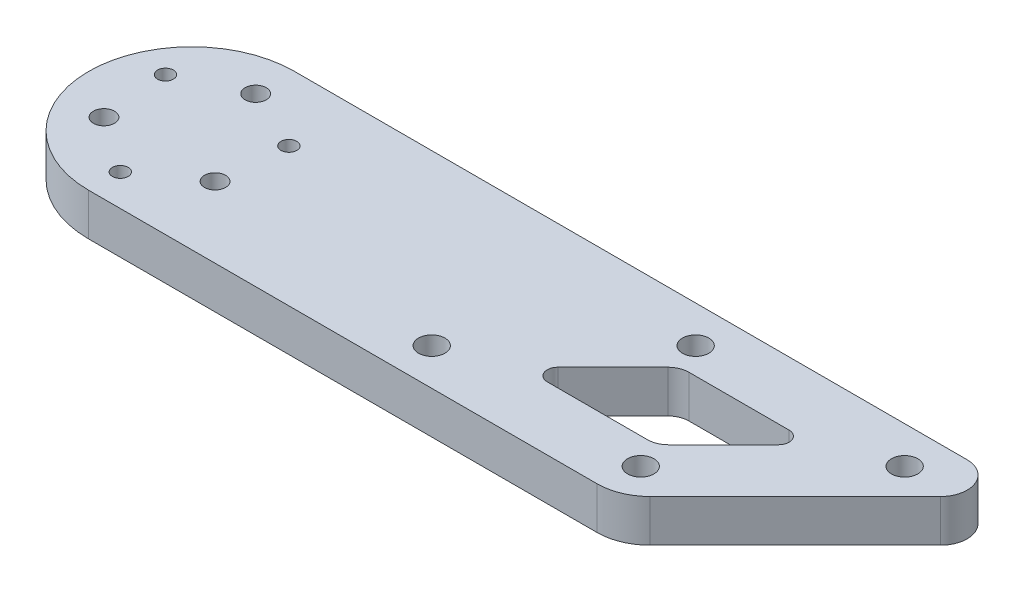
ISO-10303-21;
HEADER;
FILE_DESCRIPTION(('STEP AP214'),'2;1');
FILE_NAME('part.step','',(''),(''),'','','');
FILE_SCHEMA(('AUTOMOTIVE_DESIGN { 1 0 10303 214 1 1 1 1 }'));
ENDSEC;
DATA;
#1=APPLICATION_CONTEXT('core data for automotive mechanical design processes');
#2=APPLICATION_PROTOCOL_DEFINITION('international standard','automotive_design',2000,#1);
#3=PRODUCT_CONTEXT('',#1,'mechanical');
#4=PRODUCT('Part','Part','',(#3));
#5=PRODUCT_RELATED_PRODUCT_CATEGORY('part','',(#4));
#6=PRODUCT_DEFINITION_FORMATION('','',#4);
#7=PRODUCT_DEFINITION_CONTEXT('part definition',#1,'design');
#8=PRODUCT_DEFINITION('design','',#6,#7);
#9=PRODUCT_DEFINITION_SHAPE('','',#8);
#10=(LENGTH_UNIT() NAMED_UNIT(*) SI_UNIT(.MILLI.,.METRE.));
#11=(NAMED_UNIT(*) PLANE_ANGLE_UNIT() SI_UNIT($,.RADIAN.));
#12=(NAMED_UNIT(*) SI_UNIT($,.STERADIAN.) SOLID_ANGLE_UNIT());
#13=UNCERTAINTY_MEASURE_WITH_UNIT(LENGTH_MEASURE(1.E-05),#10,'distance_accuracy_value','');
#14=(GEOMETRIC_REPRESENTATION_CONTEXT(3) GLOBAL_UNCERTAINTY_ASSIGNED_CONTEXT((#13)) GLOBAL_UNIT_ASSIGNED_CONTEXT((#10,
#11,#12)) REPRESENTATION_CONTEXT('',''));
#15=CARTESIAN_POINT('',(0.,0.,0.));
#16=DIRECTION('',(0.,0.,1.));
#17=DIRECTION('',(1.,0.,0.));
#18=AXIS2_PLACEMENT_3D('',#15,#16,#17);
#19=CARTESIAN_POINT('',(0.,8.,0.));
#20=DIRECTION('',(0.,1.,0.));
#21=DIRECTION('',(0.,0.,1.));
#22=AXIS2_PLACEMENT_3D('',#19,#20,#21);
#23=PLANE('',#22);
#24=CARTESIAN_POINT('',(58.0025253169416,8.,12.5000000000001));
#25=DIRECTION('',(0.,-1.,0.));
#26=DIRECTION('',(0.,0.,-1.));
#27=AXIS2_PLACEMENT_3D('',#24,#25,#26);
#28=CIRCLE('',#27,2.5);
#29=CARTESIAN_POINT('',(58.0025253169416,8.,10.0000000000001));
#30=VERTEX_POINT('',#29);
#31=EDGE_CURVE('E618',#30,#30,#28,.T.);
#32=ORIENTED_EDGE('',*,*,#31,.T.);
#33=EDGE_LOOP('',(#32));
#34=FACE_BOUND('',#33,.T.);
#35=CARTESIAN_POINT('',(83.0025253169414,8.,-12.4999999999998));
#36=DIRECTION('',(0.,-1.,0.));
#37=DIRECTION('',(0.,0.,-1.));
#38=AXIS2_PLACEMENT_3D('',#35,#36,#37);
#39=CIRCLE('',#38,2.50000000000001);
#40=CARTESIAN_POINT('',(83.0025253169414,8.,-14.9999999999998));
#41=VERTEX_POINT('',#40);
#42=EDGE_CURVE('E614',#41,#41,#39,.T.);
#43=ORIENTED_EDGE('',*,*,#42,.T.);
#44=EDGE_LOOP('',(#43));
#45=FACE_BOUND('',#44,.T.);
#46=CARTESIAN_POINT('',(122.600505063388,8.,-12.4999999999998));
#47=DIRECTION('',(0.,-1.,0.));
#48=DIRECTION('',(0.,0.,-1.));
#49=AXIS2_PLACEMENT_3D('',#46,#47,#48);
#50=CIRCLE('',#49,2.49999999999999);
#51=CARTESIAN_POINT('',(122.600505063388,8.,-14.9999999999998));
#52=VERTEX_POINT('',#51);
#53=EDGE_CURVE('E494',#52,#52,#50,.T.);
#54=ORIENTED_EDGE('',*,*,#53,.T.);
#55=EDGE_LOOP('',(#54));
#56=FACE_BOUND('',#55,.T.);
#57=CARTESIAN_POINT('',(97.6005050633882,8.,12.5000000000001));
#58=DIRECTION('',(0.,-1.,0.));
#59=DIRECTION('',(0.,0.,-1.));
#60=AXIS2_PLACEMENT_3D('',#57,#58,#59);
#61=CIRCLE('',#60,2.50000000000001);
#62=CARTESIAN_POINT('',(97.6005050633882,8.,10.0000000000001));
#63=VERTEX_POINT('',#62);
#64=EDGE_CURVE('E161',#63,#63,#61,.T.);
#65=ORIENTED_EDGE('',*,*,#64,.T.);
#66=EDGE_LOOP('',(#65));
#67=FACE_BOUND('',#66,.T.);
#68=CARTESIAN_POINT('',(93.8725830020304,8.,3.49999999999995));
#69=DIRECTION('',(0.,-1.,0.));
#70=DIRECTION('',(0.,0.,1.));
#71=AXIS2_PLACEMENT_3D('',#68,#69,#70);
#72=CIRCLE('',#71,4.00000000000001);
#73=CARTESIAN_POINT('',(96.7010101267766,8.,6.32842712474616));
#74=VERTEX_POINT('',#73);
#75=CARTESIAN_POINT('',(93.8725830020304,8.,7.49999999999996));
#76=VERTEX_POINT('',#75);
#77=EDGE_CURVE('E139',#74,#76,#72,.T.);
#78=ORIENTED_EDGE('',*,*,#77,.T.);
#79=DIRECTION('',(-1.,0.,0.));
#80=VECTOR('',#79,1.);
#81=CARTESIAN_POINT('',(93.8725830020304,8.,7.49999999999996));
#82=LINE('',#81,#80);
#83=CARTESIAN_POINT('',(74.9020202535533,8.,7.49999999999996));
#84=VERTEX_POINT('',#83);
#85=EDGE_CURVE('E148',#76,#84,#82,.T.);
#86=ORIENTED_EDGE('',*,*,#85,.T.);
#87=CARTESIAN_POINT('',(74.9020202535533,8.,5.49999999999996));
#88=DIRECTION('',(0.,-1.,0.));
#89=DIRECTION('',(0.,0.,-1.));
#90=AXIS2_PLACEMENT_3D('',#87,#88,#89);
#91=CIRCLE('',#90,2.);
#92=CARTESIAN_POINT('',(73.4878066911802,8.,4.08578643762688));
#93=VERTEX_POINT('',#92);
#94=EDGE_CURVE('E51',#84,#93,#91,.T.);
#95=ORIENTED_EDGE('',*,*,#94,.T.);
#96=DIRECTION('',(0.707106781186546,0.,-0.707106781186549));
#97=VECTOR('',#96,1.);
#98=CARTESIAN_POINT('',(73.4878066911802,8.,4.08578643762687));
#99=LINE('',#98,#97);
#100=CARTESIAN_POINT('',(83.9020202535532,8.,-6.32842712474621));
#101=VERTEX_POINT('',#100);
#102=EDGE_CURVE('E165',#93,#101,#99,.T.);
#103=ORIENTED_EDGE('',*,*,#102,.T.);
#104=CARTESIAN_POINT('',(86.7304473782994,8.,-3.50000000000002));
#105=DIRECTION('',(0.,-1.,0.));
#106=DIRECTION('',(0.,0.,1.));
#107=AXIS2_PLACEMENT_3D('',#104,#105,#106);
#108=CIRCLE('',#107,4.);
#109=CARTESIAN_POINT('',(86.7304473782994,8.,-7.50000000000002));
#110=VERTEX_POINT('',#109);
#111=EDGE_CURVE('E168',#101,#110,#108,.T.);
#112=ORIENTED_EDGE('',*,*,#111,.T.);
#113=DIRECTION('',(1.,0.,0.));
#114=VECTOR('',#113,1.);
#115=CARTESIAN_POINT('',(105.701010126777,8.,-7.50000000000003));
#116=LINE('',#115,#114);
#117=CARTESIAN_POINT('',(105.701010126777,8.,-7.50000000000003));
#118=VERTEX_POINT('',#117);
#119=EDGE_CURVE('E171',#110,#118,#116,.T.);
#120=ORIENTED_EDGE('',*,*,#119,.T.);
#121=CARTESIAN_POINT('',(105.701010126777,8.,-5.50000000000003));
#122=DIRECTION('',(0.,-1.,0.));
#123=DIRECTION('',(0.,0.,1.));
#124=AXIS2_PLACEMENT_3D('',#121,#122,#123);
#125=CIRCLE('',#124,2.);
#126=CARTESIAN_POINT('',(107.11522368915,8.,-4.08578643762694));
#127=VERTEX_POINT('',#126);
#128=EDGE_CURVE('E174',#118,#127,#125,.T.);
#129=ORIENTED_EDGE('',*,*,#128,.T.);
#130=DIRECTION('',(-0.707106781186547,0.,0.707106781186548));
#131=VECTOR('',#130,1.);
#132=CARTESIAN_POINT('',(96.7010101267766,8.,6.32842712474616));
#133=LINE('',#132,#131);
#134=EDGE_CURVE('E145',#127,#74,#133,.T.);
#135=ORIENTED_EDGE('',*,*,#134,.T.);
#136=EDGE_LOOP('',(#78,#86,#95,#103,#112,#120,#129,#135));
#137=FACE_BOUND('',#136,.T.);
#138=CARTESIAN_POINT('',(11.6913429510899,8.,-6.75));
#139=DIRECTION('',(0.,1.,0.));
#140=DIRECTION('',(0.,0.,1.));
#141=AXIS2_PLACEMENT_3D('',#138,#139,#140);
#142=CIRCLE('',#141,1.5);
#143=CARTESIAN_POINT('',(11.6913429510899,8.,-5.25));
#144=VERTEX_POINT('',#143);
#145=EDGE_CURVE('E214',#144,#144,#142,.T.);
#146=ORIENTED_EDGE('',*,*,#145,.F.);
#147=EDGE_LOOP('',(#146));
#148=FACE_BOUND('',#147,.T.);
#149=CARTESIAN_POINT('',(10.522208655981,8.,6.0749999999999));
#150=DIRECTION('',(0.,1.,0.));
#151=DIRECTION('',(0.,0.,1.));
#152=AXIS2_PLACEMENT_3D('',#149,#150,#151);
#153=CIRCLE('',#152,2.);
#154=CARTESIAN_POINT('',(10.522208655981,8.,8.0749999999999));
#155=VERTEX_POINT('',#154);
#156=EDGE_CURVE('E226',#155,#155,#153,.T.);
#157=ORIENTED_EDGE('',*,*,#156,.F.);
#158=EDGE_LOOP('',(#157));
#159=FACE_BOUND('',#158,.T.);
#160=CARTESIAN_POINT('',(-10.5222086559809,8.,6.07500000000005));
#161=DIRECTION('',(0.,1.,0.));
#162=DIRECTION('',(0.,0.,1.));
#163=AXIS2_PLACEMENT_3D('',#160,#161,#162);
#164=CIRCLE('',#163,2.);
#165=CARTESIAN_POINT('',(-10.5222086559809,8.,8.07500000000005));
#166=VERTEX_POINT('',#165);
#167=EDGE_CURVE('E238',#166,#166,#164,.T.);
#168=ORIENTED_EDGE('',*,*,#167,.F.);
#169=EDGE_LOOP('',(#168));
#170=FACE_BOUND('',#169,.T.);
#171=CARTESIAN_POINT('',(0.,8.,0.));
#172=DIRECTION('',(0.,1.,0.));
#173=DIRECTION('',(0.,0.,1.));
#174=AXIS2_PLACEMENT_3D('',#171,#172,#173);
#175=CIRCLE('',#174,19.5);
#176=CARTESIAN_POINT('',(0.,8.,-19.5));
#177=VERTEX_POINT('',#176);
#178=CARTESIAN_POINT('',(0.,8.,19.5));
#179=VERTEX_POINT('',#178);
#180=EDGE_CURVE('E244',#177,#179,#175,.T.);
#181=ORIENTED_EDGE('',*,*,#180,.T.);
#182=DIRECTION('',(1.,0.,0.));
#183=VECTOR('',#182,1.);
#184=CARTESIAN_POINT('',(0.,8.,19.5));
#185=LINE('',#184,#183);
#186=CARTESIAN_POINT('',(96.3578643762691,8.,19.5));
#187=VERTEX_POINT('',#186);
#188=EDGE_CURVE('E247',#179,#187,#185,.T.);
#189=ORIENTED_EDGE('',*,*,#188,.T.);
#190=CARTESIAN_POINT('',(96.3578643762691,8.,9.5));
#191=DIRECTION('',(0.,1.,0.));
#192=DIRECTION('',(0.,0.,1.));
#193=AXIS2_PLACEMENT_3D('',#190,#191,#192);
#194=CIRCLE('',#193,10.);
#195=CARTESIAN_POINT('',(103.428932188135,8.,16.5710678118655));
#196=VERTEX_POINT('',#195);
#197=EDGE_CURVE('E250',#187,#196,#194,.T.);
#198=ORIENTED_EDGE('',*,*,#197,.T.);
#199=DIRECTION('',(0.707106781186546,0.,-0.707106781186549));
#200=VECTOR('',#199,1.);
#201=CARTESIAN_POINT('',(103.428932188135,8.,16.5710678118655));
#202=LINE('',#201,#200);
#203=CARTESIAN_POINT('',(130.964466094067,8.,-10.9644660940673));
#204=VERTEX_POINT('',#203);
#205=EDGE_CURVE('E252',#196,#204,#202,.T.);
#206=ORIENTED_EDGE('',*,*,#205,.T.);
#207=CARTESIAN_POINT('',(127.428932188134,8.,-14.5));
#208=DIRECTION('',(0.,1.,0.));
#209=DIRECTION('',(0.,0.,-1.));
#210=AXIS2_PLACEMENT_3D('',#207,#208,#209);
#211=CIRCLE('',#210,4.99999999999999);
#212=CARTESIAN_POINT('',(127.428932188134,8.,-19.5));
#213=VERTEX_POINT('',#212);
#214=EDGE_CURVE('E254',#204,#213,#211,.T.);
#215=ORIENTED_EDGE('',*,*,#214,.T.);
#216=DIRECTION('',(-1.,0.,0.));
#217=VECTOR('',#216,1.);
#218=CARTESIAN_POINT('',(0.,8.,-19.5));
#219=LINE('',#218,#217);
#220=EDGE_CURVE('E256',#213,#177,#219,.T.);
#221=ORIENTED_EDGE('',*,*,#220,.T.);
#222=EDGE_LOOP('',(#181,#189,#198,#206,#215,#221));
#223=FACE_BOUND('',#222,.T.);
#224=CARTESIAN_POINT('',(0.,8.,-12.15));
#225=DIRECTION('',(0.,1.,0.));
#226=DIRECTION('',(0.,0.,1.));
#227=AXIS2_PLACEMENT_3D('',#224,#225,#226);
#228=CIRCLE('',#227,2.);
#229=CARTESIAN_POINT('',(0.,8.,-10.15));
#230=VERTEX_POINT('',#229);
#231=EDGE_CURVE('E232',#230,#230,#228,.T.);
#232=ORIENTED_EDGE('',*,*,#231,.F.);
#233=EDGE_LOOP('',(#232));
#234=FACE_BOUND('',#233,.T.);
#235=CARTESIAN_POINT('',(-11.6913429510899,8.,-6.75));
#236=DIRECTION('',(0.,1.,0.));
#237=DIRECTION('',(0.,0.,1.));
#238=AXIS2_PLACEMENT_3D('',#235,#236,#237);
#239=CIRCLE('',#238,1.5);
#240=CARTESIAN_POINT('',(-11.6913429510899,8.,-5.25));
#241=VERTEX_POINT('',#240);
#242=EDGE_CURVE('E220',#241,#241,#239,.T.);
#243=ORIENTED_EDGE('',*,*,#242,.F.);
#244=EDGE_LOOP('',(#243));
#245=FACE_BOUND('',#244,.T.);
#246=CARTESIAN_POINT('',(0.,8.,13.5));
#247=DIRECTION('',(0.,1.,0.));
#248=DIRECTION('',(0.,0.,1.));
#249=AXIS2_PLACEMENT_3D('',#246,#247,#248);
#250=CIRCLE('',#249,1.5);
#251=CARTESIAN_POINT('',(0.,8.,15.));
#252=VERTEX_POINT('',#251);
#253=EDGE_CURVE('E208',#252,#252,#250,.T.);
#254=ORIENTED_EDGE('',*,*,#253,.F.);
#255=EDGE_LOOP('',(#254));
#256=FACE_BOUND('',#255,.T.);
#257=ADVANCED_FACE('F34',(#34,#45,#56,#67,#137,#148,#159,#170,#223,#234,#245,#256),#23,.T.);
#258=CARTESIAN_POINT('',(0.,0.,0.));
#259=DIRECTION('',(0.,1.,0.));
#260=DIRECTION('',(0.,0.,1.));
#261=AXIS2_PLACEMENT_3D('',#258,#259,#260);
#262=PLANE('',#261);
#263=CARTESIAN_POINT('',(58.0025253169416,0.,12.5000000000001));
#264=DIRECTION('',(0.,1.,0.));
#265=DIRECTION('',(0.,0.,1.));
#266=AXIS2_PLACEMENT_3D('',#263,#264,#265);
#267=CIRCLE('',#266,2.5);
#268=CARTESIAN_POINT('',(58.0025253169416,0.,15.0000000000001));
#269=VERTEX_POINT('',#268);
#270=EDGE_CURVE('E38',#269,#269,#267,.T.);
#271=ORIENTED_EDGE('',*,*,#270,.T.);
#272=EDGE_LOOP('',(#271));
#273=FACE_BOUND('',#272,.T.);
#274=CARTESIAN_POINT('',(83.0025253169414,0.,-12.4999999999998));
#275=DIRECTION('',(0.,1.,0.));
#276=DIRECTION('',(0.,0.,1.));
#277=AXIS2_PLACEMENT_3D('',#274,#275,#276);
#278=CIRCLE('',#277,2.50000000000001);
#279=CARTESIAN_POINT('',(83.0025253169414,0.,-9.99999999999979));
#280=VERTEX_POINT('',#279);
#281=EDGE_CURVE('E288',#280,#280,#278,.T.);
#282=ORIENTED_EDGE('',*,*,#281,.T.);
#283=EDGE_LOOP('',(#282));
#284=FACE_BOUND('',#283,.T.);
#285=CARTESIAN_POINT('',(122.600505063388,0.,-12.4999999999998));
#286=DIRECTION('',(0.,1.,0.));
#287=DIRECTION('',(0.,0.,1.));
#288=AXIS2_PLACEMENT_3D('',#285,#286,#287);
#289=CIRCLE('',#288,2.49999999999999);
#290=CARTESIAN_POINT('',(122.600505063388,0.,-9.99999999999985));
#291=VERTEX_POINT('',#290);
#292=EDGE_CURVE('E286',#291,#291,#289,.T.);
#293=ORIENTED_EDGE('',*,*,#292,.T.);
#294=EDGE_LOOP('',(#293));
#295=FACE_BOUND('',#294,.T.);
#296=CARTESIAN_POINT('',(97.6005050633882,0.,12.5000000000001));
#297=DIRECTION('',(0.,1.,0.));
#298=DIRECTION('',(0.,0.,1.));
#299=AXIS2_PLACEMENT_3D('',#296,#297,#298);
#300=CIRCLE('',#299,2.50000000000001);
#301=CARTESIAN_POINT('',(97.6005050633882,0.,15.0000000000001));
#302=VERTEX_POINT('',#301);
#303=EDGE_CURVE('E283',#302,#302,#300,.T.);
#304=ORIENTED_EDGE('',*,*,#303,.T.);
#305=EDGE_LOOP('',(#304));
#306=FACE_BOUND('',#305,.T.);
#307=DIRECTION('',(-1.,0.,0.));
#308=VECTOR('',#307,1.);
#309=CARTESIAN_POINT('',(93.8725830020304,0.,7.49999999999996));
#310=LINE('',#309,#308);
#311=CARTESIAN_POINT('',(93.8725830020304,0.,7.49999999999996));
#312=VERTEX_POINT('',#311);
#313=CARTESIAN_POINT('',(74.9020202535533,0.,7.49999999999996));
#314=VERTEX_POINT('',#313);
#315=EDGE_CURVE('E178',#312,#314,#310,.T.);
#316=ORIENTED_EDGE('',*,*,#315,.F.);
#317=CARTESIAN_POINT('',(93.8725830020304,0.,3.49999999999995));
#318=DIRECTION('',(0.,-1.,0.));
#319=DIRECTION('',(0.,0.,1.));
#320=AXIS2_PLACEMENT_3D('',#317,#318,#319);
#321=CIRCLE('',#320,4.00000000000001);
#322=CARTESIAN_POINT('',(96.7010101267766,0.,6.32842712474616));
#323=VERTEX_POINT('',#322);
#324=EDGE_CURVE('E59',#323,#312,#321,.T.);
#325=ORIENTED_EDGE('',*,*,#324,.F.);
#326=DIRECTION('',(-0.707106781186547,0.,0.707106781186548));
#327=VECTOR('',#326,1.);
#328=CARTESIAN_POINT('',(96.7010101267766,0.,6.32842712474616));
#329=LINE('',#328,#327);
#330=CARTESIAN_POINT('',(107.11522368915,0.,-4.08578643762694));
#331=VERTEX_POINT('',#330);
#332=EDGE_CURVE('E155',#331,#323,#329,.T.);
#333=ORIENTED_EDGE('',*,*,#332,.F.);
#334=CARTESIAN_POINT('',(105.701010126777,0.,-5.50000000000003));
#335=DIRECTION('',(0.,-1.,0.));
#336=DIRECTION('',(0.,0.,1.));
#337=AXIS2_PLACEMENT_3D('',#334,#335,#336);
#338=CIRCLE('',#337,2.);
#339=CARTESIAN_POINT('',(105.701010126777,0.,-7.50000000000003));
#340=VERTEX_POINT('',#339);
#341=EDGE_CURVE('E158',#340,#331,#338,.T.);
#342=ORIENTED_EDGE('',*,*,#341,.F.);
#343=DIRECTION('',(1.,0.,0.));
#344=VECTOR('',#343,1.);
#345=CARTESIAN_POINT('',(105.701010126777,0.,-7.50000000000003));
#346=LINE('',#345,#344);
#347=CARTESIAN_POINT('',(86.7304473782994,0.,-7.50000000000002));
#348=VERTEX_POINT('',#347);
#349=EDGE_CURVE('E189',#348,#340,#346,.T.);
#350=ORIENTED_EDGE('',*,*,#349,.F.);
#351=CARTESIAN_POINT('',(86.7304473782994,0.,-3.50000000000002));
#352=DIRECTION('',(0.,-1.,0.));
#353=DIRECTION('',(0.,0.,1.));
#354=AXIS2_PLACEMENT_3D('',#351,#352,#353);
#355=CIRCLE('',#354,4.);
#356=CARTESIAN_POINT('',(83.9020202535532,0.,-6.32842712474621));
#357=VERTEX_POINT('',#356);
#358=EDGE_CURVE('E186',#357,#348,#355,.T.);
#359=ORIENTED_EDGE('',*,*,#358,.F.);
#360=DIRECTION('',(0.707106781186546,0.,-0.707106781186549));
#361=VECTOR('',#360,1.);
#362=CARTESIAN_POINT('',(73.4878066911802,0.,4.08578643762687));
#363=LINE('',#362,#361);
#364=CARTESIAN_POINT('',(73.4878066911802,0.,4.08578643762688));
#365=VERTEX_POINT('',#364);
#366=EDGE_CURVE('E183',#365,#357,#363,.T.);
#367=ORIENTED_EDGE('',*,*,#366,.F.);
#368=CARTESIAN_POINT('',(74.9020202535533,0.,5.49999999999996));
#369=DIRECTION('',(0.,-1.,0.));
#370=DIRECTION('',(0.,0.,-1.));
#371=AXIS2_PLACEMENT_3D('',#368,#369,#370);
#372=CIRCLE('',#371,2.);
#373=EDGE_CURVE('E180',#314,#365,#372,.T.);
#374=ORIENTED_EDGE('',*,*,#373,.F.);
#375=EDGE_LOOP('',(#316,#325,#333,#342,#350,#359,#367,#374));
#376=FACE_BOUND('',#375,.T.);
#377=CARTESIAN_POINT('',(0.,0.,0.));
#378=DIRECTION('',(0.,1.,0.));
#379=DIRECTION('',(0.,0.,1.));
#380=AXIS2_PLACEMENT_3D('',#377,#378,#379);
#381=CIRCLE('',#380,19.5);
#382=CARTESIAN_POINT('',(0.,0.,-19.5));
#383=VERTEX_POINT('',#382);
#384=CARTESIAN_POINT('',(0.,0.,19.5));
#385=VERTEX_POINT('',#384);
#386=EDGE_CURVE('E241',#383,#385,#381,.T.);
#387=ORIENTED_EDGE('',*,*,#386,.F.);
#388=DIRECTION('',(-1.,0.,0.));
#389=VECTOR('',#388,1.);
#390=CARTESIAN_POINT('',(0.,0.,-19.5));
#391=LINE('',#390,#389);
#392=CARTESIAN_POINT('',(127.428932188134,0.,-19.5));
#393=VERTEX_POINT('',#392);
#394=EDGE_CURVE('E248',#393,#383,#391,.T.);
#395=ORIENTED_EDGE('',*,*,#394,.F.);
#396=CARTESIAN_POINT('',(127.428932188134,0.,-14.5));
#397=DIRECTION('',(0.,1.,0.));
#398=DIRECTION('',(0.,0.,-1.));
#399=AXIS2_PLACEMENT_3D('',#396,#397,#398);
#400=CIRCLE('',#399,4.99999999999999);
#401=CARTESIAN_POINT('',(130.964466094067,0.,-10.9644660940673));
#402=VERTEX_POINT('',#401);
#403=EDGE_CURVE('E267',#402,#393,#400,.T.);
#404=ORIENTED_EDGE('',*,*,#403,.F.);
#405=DIRECTION('',(0.707106781186546,0.,-0.707106781186549));
#406=VECTOR('',#405,1.);
#407=CARTESIAN_POINT('',(103.428932188135,0.,16.5710678118655));
#408=LINE('',#407,#406);
#409=CARTESIAN_POINT('',(103.428932188135,0.,16.5710678118655));
#410=VERTEX_POINT('',#409);
#411=EDGE_CURVE('E265',#410,#402,#408,.T.);
#412=ORIENTED_EDGE('',*,*,#411,.F.);
#413=CARTESIAN_POINT('',(96.3578643762691,0.,9.5));
#414=DIRECTION('',(0.,1.,0.));
#415=DIRECTION('',(0.,0.,1.));
#416=AXIS2_PLACEMENT_3D('',#413,#414,#415);
#417=CIRCLE('',#416,10.);
#418=CARTESIAN_POINT('',(96.3578643762691,0.,19.5));
#419=VERTEX_POINT('',#418);
#420=EDGE_CURVE('E263',#419,#410,#417,.T.);
#421=ORIENTED_EDGE('',*,*,#420,.F.);
#422=DIRECTION('',(1.,0.,0.));
#423=VECTOR('',#422,1.);
#424=CARTESIAN_POINT('',(0.,0.,19.5));
#425=LINE('',#424,#423);
#426=EDGE_CURVE('E261',#385,#419,#425,.T.);
#427=ORIENTED_EDGE('',*,*,#426,.F.);
#428=EDGE_LOOP('',(#387,#395,#404,#412,#421,#427));
#429=FACE_BOUND('',#428,.T.);
#430=CARTESIAN_POINT('',(-10.5222086559809,0.,6.07500000000005));
#431=DIRECTION('',(0.,1.,0.));
#432=DIRECTION('',(0.,0.,1.));
#433=AXIS2_PLACEMENT_3D('',#430,#431,#432);
#434=CIRCLE('',#433,2.);
#435=CARTESIAN_POINT('',(-10.5222086559809,0.,8.07500000000005));
#436=VERTEX_POINT('',#435);
#437=EDGE_CURVE('E235',#436,#436,#434,.T.);
#438=ORIENTED_EDGE('',*,*,#437,.T.);
#439=EDGE_LOOP('',(#438));
#440=FACE_BOUND('',#439,.T.);
#441=CARTESIAN_POINT('',(0.,0.,-12.15));
#442=DIRECTION('',(0.,1.,0.));
#443=DIRECTION('',(0.,0.,1.));
#444=AXIS2_PLACEMENT_3D('',#441,#442,#443);
#445=CIRCLE('',#444,2.);
#446=CARTESIAN_POINT('',(0.,0.,-10.15));
#447=VERTEX_POINT('',#446);
#448=EDGE_CURVE('E229',#447,#447,#445,.T.);
#449=ORIENTED_EDGE('',*,*,#448,.T.);
#450=EDGE_LOOP('',(#449));
#451=FACE_BOUND('',#450,.T.);
#452=CARTESIAN_POINT('',(10.522208655981,0.,6.0749999999999));
#453=DIRECTION('',(0.,1.,0.));
#454=DIRECTION('',(0.,0.,1.));
#455=AXIS2_PLACEMENT_3D('',#452,#453,#454);
#456=CIRCLE('',#455,2.);
#457=CARTESIAN_POINT('',(10.522208655981,0.,8.0749999999999));
#458=VERTEX_POINT('',#457);
#459=EDGE_CURVE('E223',#458,#458,#456,.T.);
#460=ORIENTED_EDGE('',*,*,#459,.T.);
#461=EDGE_LOOP('',(#460));
#462=FACE_BOUND('',#461,.T.);
#463=CARTESIAN_POINT('',(-11.6913429510899,0.,-6.75));
#464=DIRECTION('',(0.,1.,0.));
#465=DIRECTION('',(0.,0.,1.));
#466=AXIS2_PLACEMENT_3D('',#463,#464,#465);
#467=CIRCLE('',#466,1.5);
#468=CARTESIAN_POINT('',(-11.6913429510899,0.,-5.25));
#469=VERTEX_POINT('',#468);
#470=EDGE_CURVE('E217',#469,#469,#467,.T.);
#471=ORIENTED_EDGE('',*,*,#470,.T.);
#472=EDGE_LOOP('',(#471));
#473=FACE_BOUND('',#472,.T.);
#474=CARTESIAN_POINT('',(11.6913429510899,0.,-6.75));
#475=DIRECTION('',(0.,1.,0.));
#476=DIRECTION('',(0.,0.,1.));
#477=AXIS2_PLACEMENT_3D('',#474,#475,#476);
#478=CIRCLE('',#477,1.5);
#479=CARTESIAN_POINT('',(11.6913429510899,0.,-5.25));
#480=VERTEX_POINT('',#479);
#481=EDGE_CURVE('E211',#480,#480,#478,.T.);
#482=ORIENTED_EDGE('',*,*,#481,.T.);
#483=EDGE_LOOP('',(#482));
#484=FACE_BOUND('',#483,.T.);
#485=CARTESIAN_POINT('',(0.,0.,13.5));
#486=DIRECTION('',(0.,1.,0.));
#487=DIRECTION('',(0.,0.,1.));
#488=AXIS2_PLACEMENT_3D('',#485,#486,#487);
#489=CIRCLE('',#488,1.5);
#490=CARTESIAN_POINT('',(0.,0.,15.));
#491=VERTEX_POINT('',#490);
#492=EDGE_CURVE('E196',#491,#491,#489,.T.);
#493=ORIENTED_EDGE('',*,*,#492,.T.);
#494=EDGE_LOOP('',(#493));
#495=FACE_BOUND('',#494,.T.);
#496=ADVANCED_FACE('F295',(#273,#284,#295,#306,#376,#429,#440,#451,#462,#473,#484,#495),#262,.F.);
#497=CARTESIAN_POINT('',(0.,8.,0.));
#498=DIRECTION('',(0.,-1.,0.));
#499=DIRECTION('',(0.,0.,-1.));
#500=AXIS2_PLACEMENT_3D('',#497,#498,#499);
#501=CYLINDRICAL_SURFACE('',#500,19.5);
#502=ORIENTED_EDGE('',*,*,#386,.T.);
#503=DIRECTION('',(0.,-1.,0.));
#504=VECTOR('',#503,1.);
#505=CARTESIAN_POINT('',(0.,8.,19.5));
#506=LINE('',#505,#504);
#507=EDGE_CURVE('E11',#179,#385,#506,.T.);
#508=ORIENTED_EDGE('',*,*,#507,.F.);
#509=ORIENTED_EDGE('',*,*,#180,.F.);
#510=DIRECTION('',(0.,-1.,0.));
#511=VECTOR('',#510,1.);
#512=CARTESIAN_POINT('',(0.,8.,-19.5));
#513=LINE('',#512,#511);
#514=EDGE_CURVE('E258',#177,#383,#513,.T.);
#515=ORIENTED_EDGE('',*,*,#514,.T.);
#516=EDGE_LOOP('',(#502,#508,#509,#515));
#517=FACE_BOUND('',#516,.T.);
#518=ADVANCED_FACE('F36',(#517),#501,.T.);
#519=CARTESIAN_POINT('',(0.,8.,19.5));
#520=DIRECTION('',(0.,0.,-1.));
#521=DIRECTION('',(-1.,0.,0.));
#522=AXIS2_PLACEMENT_3D('',#519,#520,#521);
#523=PLANE('',#522);
#524=ORIENTED_EDGE('',*,*,#426,.T.);
#525=DIRECTION('',(0.,-1.,0.));
#526=VECTOR('',#525,1.);
#527=CARTESIAN_POINT('',(96.3578643762691,8.,19.5));
#528=LINE('',#527,#526);
#529=EDGE_CURVE('E43',#187,#419,#528,.T.);
#530=ORIENTED_EDGE('',*,*,#529,.F.);
#531=ORIENTED_EDGE('',*,*,#188,.F.);
#532=ORIENTED_EDGE('',*,*,#507,.T.);
#533=EDGE_LOOP('',(#524,#530,#531,#532));
#534=FACE_BOUND('',#533,.T.);
#535=ADVANCED_FACE('F338',(#534),#523,.F.);
#536=CARTESIAN_POINT('',(96.3578643762691,8.,9.5));
#537=DIRECTION('',(0.,-1.,0.));
#538=DIRECTION('',(0.,0.,-1.));
#539=AXIS2_PLACEMENT_3D('',#536,#537,#538);
#540=CYLINDRICAL_SURFACE('',#539,10.);
#541=ORIENTED_EDGE('',*,*,#420,.T.);
#542=DIRECTION('',(0.,-1.,0.));
#543=VECTOR('',#542,1.);
#544=CARTESIAN_POINT('',(103.428932188135,8.,16.5710678118655));
#545=LINE('',#544,#543);
#546=EDGE_CURVE('E278',#196,#410,#545,.T.);
#547=ORIENTED_EDGE('',*,*,#546,.F.);
#548=ORIENTED_EDGE('',*,*,#197,.F.);
#549=ORIENTED_EDGE('',*,*,#529,.T.);
#550=EDGE_LOOP('',(#541,#547,#548,#549));
#551=FACE_BOUND('',#550,.T.);
#552=ADVANCED_FACE('F335',(#551),#540,.T.);
#553=CARTESIAN_POINT('',(103.428932188135,8.,16.5710678118655));
#554=DIRECTION('',(-0.707106781186549,0.,-0.707106781186546));
#555=DIRECTION('',(-0.707106781186546,0.,0.707106781186549));
#556=AXIS2_PLACEMENT_3D('',#553,#554,#555);
#557=PLANE('',#556);
#558=ORIENTED_EDGE('',*,*,#411,.T.);
#559=DIRECTION('',(0.,-1.,0.));
#560=VECTOR('',#559,1.);
#561=CARTESIAN_POINT('',(130.964466094067,8.,-10.9644660940673));
#562=LINE('',#561,#560);
#563=EDGE_CURVE('E275',#204,#402,#562,.T.);
#564=ORIENTED_EDGE('',*,*,#563,.F.);
#565=ORIENTED_EDGE('',*,*,#205,.F.);
#566=ORIENTED_EDGE('',*,*,#546,.T.);
#567=EDGE_LOOP('',(#558,#564,#565,#566));
#568=FACE_BOUND('',#567,.T.);
#569=ADVANCED_FACE('F331',(#568),#557,.F.);
#570=CARTESIAN_POINT('',(127.428932188134,8.,-14.5));
#571=DIRECTION('',(0.,-1.,0.));
#572=DIRECTION('',(0.,0.,-1.));
#573=AXIS2_PLACEMENT_3D('',#570,#571,#572);
#574=CYLINDRICAL_SURFACE('',#573,4.99999999999999);
#575=ORIENTED_EDGE('',*,*,#403,.T.);
#576=DIRECTION('',(0.,-1.,0.));
#577=VECTOR('',#576,1.);
#578=CARTESIAN_POINT('',(127.428932188134,8.,-19.5));
#579=LINE('',#578,#577);
#580=EDGE_CURVE('E272',#213,#393,#579,.T.);
#581=ORIENTED_EDGE('',*,*,#580,.F.);
#582=ORIENTED_EDGE('',*,*,#214,.F.);
#583=ORIENTED_EDGE('',*,*,#563,.T.);
#584=EDGE_LOOP('',(#575,#581,#582,#583));
#585=FACE_BOUND('',#584,.T.);
#586=ADVANCED_FACE('F327',(#585),#574,.T.);
#587=CARTESIAN_POINT('',(0.,8.,-19.5));
#588=DIRECTION('',(0.,0.,1.));
#589=DIRECTION('',(1.,0.,0.));
#590=AXIS2_PLACEMENT_3D('',#587,#588,#589);
#591=PLANE('',#590);
#592=ORIENTED_EDGE('',*,*,#394,.T.);
#593=ORIENTED_EDGE('',*,*,#514,.F.);
#594=ORIENTED_EDGE('',*,*,#220,.F.);
#595=ORIENTED_EDGE('',*,*,#580,.T.);
#596=EDGE_LOOP('',(#592,#593,#594,#595));
#597=FACE_BOUND('',#596,.T.);
#598=ADVANCED_FACE('F324',(#597),#591,.F.);
#599=CARTESIAN_POINT('',(-10.5222086559809,8.,6.07500000000005));
#600=DIRECTION('',(0.,-1.,0.));
#601=DIRECTION('',(0.,0.,-1.));
#602=AXIS2_PLACEMENT_3D('',#599,#600,#601);
#603=CYLINDRICAL_SURFACE('',#602,2.);
#604=ORIENTED_EDGE('',*,*,#167,.T.);
#605=EDGE_LOOP('',(#604));
#606=FACE_BOUND('',#605,.T.);
#607=ORIENTED_EDGE('',*,*,#437,.F.);
#608=EDGE_LOOP('',(#607));
#609=FACE_BOUND('',#608,.T.);
#610=ADVANCED_FACE('F321',(#606,#609),#603,.F.);
#611=CARTESIAN_POINT('',(0.,8.,-12.15));
#612=DIRECTION('',(0.,-1.,0.));
#613=DIRECTION('',(0.,0.,-1.));
#614=AXIS2_PLACEMENT_3D('',#611,#612,#613);
#615=CYLINDRICAL_SURFACE('',#614,2.);
#616=ORIENTED_EDGE('',*,*,#231,.T.);
#617=EDGE_LOOP('',(#616));
#618=FACE_BOUND('',#617,.T.);
#619=ORIENTED_EDGE('',*,*,#448,.F.);
#620=EDGE_LOOP('',(#619));
#621=FACE_BOUND('',#620,.T.);
#622=ADVANCED_FACE('F395',(#618,#621),#615,.F.);
#623=CARTESIAN_POINT('',(10.522208655981,8.,6.0749999999999));
#624=DIRECTION('',(0.,-1.,0.));
#625=DIRECTION('',(0.,0.,-1.));
#626=AXIS2_PLACEMENT_3D('',#623,#624,#625);
#627=CYLINDRICAL_SURFACE('',#626,2.);
#628=ORIENTED_EDGE('',*,*,#156,.T.);
#629=EDGE_LOOP('',(#628));
#630=FACE_BOUND('',#629,.T.);
#631=ORIENTED_EDGE('',*,*,#459,.F.);
#632=EDGE_LOOP('',(#631));
#633=FACE_BOUND('',#632,.T.);
#634=ADVANCED_FACE('F392',(#630,#633),#627,.F.);
#635=CARTESIAN_POINT('',(-11.6913429510899,8.,-6.75));
#636=DIRECTION('',(0.,-1.,0.));
#637=DIRECTION('',(0.,0.,-1.));
#638=AXIS2_PLACEMENT_3D('',#635,#636,#637);
#639=CYLINDRICAL_SURFACE('',#638,1.5);
#640=ORIENTED_EDGE('',*,*,#242,.T.);
#641=EDGE_LOOP('',(#640));
#642=FACE_BOUND('',#641,.T.);
#643=ORIENTED_EDGE('',*,*,#470,.F.);
#644=EDGE_LOOP('',(#643));
#645=FACE_BOUND('',#644,.T.);
#646=ADVANCED_FACE('F385',(#642,#645),#639,.F.);
#647=CARTESIAN_POINT('',(11.6913429510899,8.,-6.75));
#648=DIRECTION('',(0.,-1.,0.));
#649=DIRECTION('',(0.,0.,-1.));
#650=AXIS2_PLACEMENT_3D('',#647,#648,#649);
#651=CYLINDRICAL_SURFACE('',#650,1.5);
#652=ORIENTED_EDGE('',*,*,#145,.T.);
#653=EDGE_LOOP('',(#652));
#654=FACE_BOUND('',#653,.T.);
#655=ORIENTED_EDGE('',*,*,#481,.F.);
#656=EDGE_LOOP('',(#655));
#657=FACE_BOUND('',#656,.T.);
#658=ADVANCED_FACE('F375',(#654,#657),#651,.F.);
#659=CARTESIAN_POINT('',(0.,8.,13.5));
#660=DIRECTION('',(0.,-1.,0.));
#661=DIRECTION('',(0.,0.,-1.));
#662=AXIS2_PLACEMENT_3D('',#659,#660,#661);
#663=CYLINDRICAL_SURFACE('',#662,1.5);
#664=ORIENTED_EDGE('',*,*,#253,.T.);
#665=EDGE_LOOP('',(#664));
#666=FACE_BOUND('',#665,.T.);
#667=ORIENTED_EDGE('',*,*,#492,.F.);
#668=EDGE_LOOP('',(#667));
#669=FACE_BOUND('',#668,.T.);
#670=ADVANCED_FACE('F372',(#666,#669),#663,.F.);
#671=CARTESIAN_POINT('',(93.8725830020304,8.,3.49999999999995));
#672=DIRECTION('',(0.,-1.,0.));
#673=DIRECTION('',(0.,0.,-1.));
#674=AXIS2_PLACEMENT_3D('',#671,#672,#673);
#675=CYLINDRICAL_SURFACE('',#674,4.00000000000001);
#676=ORIENTED_EDGE('',*,*,#324,.T.);
#677=DIRECTION('',(0.,-1.,0.));
#678=VECTOR('',#677,1.);
#679=CARTESIAN_POINT('',(93.8725830020304,8.,7.49999999999996));
#680=LINE('',#679,#678);
#681=EDGE_CURVE('E135',#76,#312,#680,.T.);
#682=ORIENTED_EDGE('',*,*,#681,.F.);
#683=ORIENTED_EDGE('',*,*,#77,.F.);
#684=DIRECTION('',(0.,-1.,0.));
#685=VECTOR('',#684,1.);
#686=CARTESIAN_POINT('',(96.7010101267766,8.,6.32842712474616));
#687=LINE('',#686,#685);
#688=EDGE_CURVE('E194',#74,#323,#687,.T.);
#689=ORIENTED_EDGE('',*,*,#688,.T.);
#690=EDGE_LOOP('',(#676,#682,#683,#689));
#691=FACE_BOUND('',#690,.T.);
#692=ADVANCED_FACE('F137',(#691),#675,.F.);
#693=CARTESIAN_POINT('',(96.7010101267766,8.,6.32842712474616));
#694=DIRECTION('',(0.707106781186548,0.,0.707106781186547));
#695=DIRECTION('',(0.707106781186547,0.,-0.707106781186548));
#696=AXIS2_PLACEMENT_3D('',#693,#694,#695);
#697=PLANE('',#696);
#698=ORIENTED_EDGE('',*,*,#332,.T.);
#699=ORIENTED_EDGE('',*,*,#688,.F.);
#700=ORIENTED_EDGE('',*,*,#134,.F.);
#701=DIRECTION('',(0.,-1.,0.));
#702=VECTOR('',#701,1.);
#703=CARTESIAN_POINT('',(107.11522368915,8.,-4.08578643762694));
#704=LINE('',#703,#702);
#705=EDGE_CURVE('E197',#127,#331,#704,.T.);
#706=ORIENTED_EDGE('',*,*,#705,.T.);
#707=EDGE_LOOP('',(#698,#699,#700,#706));
#708=FACE_BOUND('',#707,.T.);
#709=ADVANCED_FACE('F383',(#708),#697,.F.);
#710=CARTESIAN_POINT('',(105.701010126777,8.,-5.50000000000003));
#711=DIRECTION('',(0.,-1.,0.));
#712=DIRECTION('',(0.,0.,-1.));
#713=AXIS2_PLACEMENT_3D('',#710,#711,#712);
#714=CYLINDRICAL_SURFACE('',#713,2.);
#715=ORIENTED_EDGE('',*,*,#341,.T.);
#716=ORIENTED_EDGE('',*,*,#705,.F.);
#717=ORIENTED_EDGE('',*,*,#128,.F.);
#718=DIRECTION('',(0.,-1.,0.));
#719=VECTOR('',#718,1.);
#720=CARTESIAN_POINT('',(105.701010126777,8.,-7.50000000000003));
#721=LINE('',#720,#719);
#722=EDGE_CURVE('E199',#118,#340,#721,.T.);
#723=ORIENTED_EDGE('',*,*,#722,.T.);
#724=EDGE_LOOP('',(#715,#716,#717,#723));
#725=FACE_BOUND('',#724,.T.);
#726=ADVANCED_FACE('F518',(#725),#714,.F.);
#727=CARTESIAN_POINT('',(105.701010126777,8.,-7.50000000000003));
#728=DIRECTION('',(0.,0.,-1.));
#729=DIRECTION('',(-1.,0.,0.));
#730=AXIS2_PLACEMENT_3D('',#727,#728,#729);
#731=PLANE('',#730);
#732=ORIENTED_EDGE('',*,*,#349,.T.);
#733=ORIENTED_EDGE('',*,*,#722,.F.);
#734=ORIENTED_EDGE('',*,*,#119,.F.);
#735=DIRECTION('',(0.,-1.,0.));
#736=VECTOR('',#735,1.);
#737=CARTESIAN_POINT('',(86.7304473782994,8.,-7.50000000000002));
#738=LINE('',#737,#736);
#739=EDGE_CURVE('E201',#110,#348,#738,.T.);
#740=ORIENTED_EDGE('',*,*,#739,.T.);
#741=EDGE_LOOP('',(#732,#733,#734,#740));
#742=FACE_BOUND('',#741,.T.);
#743=ADVANCED_FACE('F514',(#742),#731,.F.);
#744=CARTESIAN_POINT('',(86.7304473782994,8.,-3.50000000000002));
#745=DIRECTION('',(0.,-1.,0.));
#746=DIRECTION('',(0.,0.,-1.));
#747=AXIS2_PLACEMENT_3D('',#744,#745,#746);
#748=CYLINDRICAL_SURFACE('',#747,4.);
#749=ORIENTED_EDGE('',*,*,#358,.T.);
#750=ORIENTED_EDGE('',*,*,#739,.F.);
#751=ORIENTED_EDGE('',*,*,#111,.F.);
#752=DIRECTION('',(0.,-1.,0.));
#753=VECTOR('',#752,1.);
#754=CARTESIAN_POINT('',(83.9020202535532,8.,-6.32842712474621));
#755=LINE('',#754,#753);
#756=EDGE_CURVE('E203',#101,#357,#755,.T.);
#757=ORIENTED_EDGE('',*,*,#756,.T.);
#758=EDGE_LOOP('',(#749,#750,#751,#757));
#759=FACE_BOUND('',#758,.T.);
#760=ADVANCED_FACE('F511',(#759),#748,.F.);
#761=CARTESIAN_POINT('',(73.4878066911802,8.,4.08578643762687));
#762=DIRECTION('',(-0.707106781186549,0.,-0.707106781186546));
#763=DIRECTION('',(-0.707106781186546,0.,0.707106781186549));
#764=AXIS2_PLACEMENT_3D('',#761,#762,#763);
#765=PLANE('',#764);
#766=ORIENTED_EDGE('',*,*,#366,.T.);
#767=ORIENTED_EDGE('',*,*,#756,.F.);
#768=ORIENTED_EDGE('',*,*,#102,.F.);
#769=DIRECTION('',(0.,-1.,0.));
#770=VECTOR('',#769,1.);
#771=CARTESIAN_POINT('',(73.4878066911802,8.,4.08578643762688));
#772=LINE('',#771,#770);
#773=EDGE_CURVE('E205',#93,#365,#772,.T.);
#774=ORIENTED_EDGE('',*,*,#773,.T.);
#775=EDGE_LOOP('',(#766,#767,#768,#774));
#776=FACE_BOUND('',#775,.T.);
#777=ADVANCED_FACE('F507',(#776),#765,.F.);
#778=CARTESIAN_POINT('',(74.9020202535533,8.,5.49999999999996));
#779=DIRECTION('',(0.,-1.,0.));
#780=DIRECTION('',(0.,0.,-1.));
#781=AXIS2_PLACEMENT_3D('',#778,#779,#780);
#782=CYLINDRICAL_SURFACE('',#781,2.);
#783=ORIENTED_EDGE('',*,*,#373,.T.);
#784=ORIENTED_EDGE('',*,*,#773,.F.);
#785=ORIENTED_EDGE('',*,*,#94,.F.);
#786=DIRECTION('',(0.,-1.,0.));
#787=VECTOR('',#786,1.);
#788=CARTESIAN_POINT('',(74.9020202535533,8.,7.49999999999996));
#789=LINE('',#788,#787);
#790=EDGE_CURVE('E144',#84,#314,#789,.T.);
#791=ORIENTED_EDGE('',*,*,#790,.T.);
#792=EDGE_LOOP('',(#783,#784,#785,#791));
#793=FACE_BOUND('',#792,.T.);
#794=ADVANCED_FACE('F504',(#793),#782,.F.);
#795=CARTESIAN_POINT('',(93.8725830020304,8.,7.49999999999996));
#796=DIRECTION('',(0.,0.,1.));
#797=DIRECTION('',(1.,0.,0.));
#798=AXIS2_PLACEMENT_3D('',#795,#796,#797);
#799=PLANE('',#798);
#800=ORIENTED_EDGE('',*,*,#315,.T.);
#801=ORIENTED_EDGE('',*,*,#790,.F.);
#802=ORIENTED_EDGE('',*,*,#85,.F.);
#803=ORIENTED_EDGE('',*,*,#681,.T.);
#804=EDGE_LOOP('',(#800,#801,#802,#803));
#805=FACE_BOUND('',#804,.T.);
#806=ADVANCED_FACE('F149',(#805),#799,.F.);
#807=CARTESIAN_POINT('',(97.6005050633882,8.,12.5000000000001));
#808=DIRECTION('',(0.,-1.,0.));
#809=DIRECTION('',(0.,0.,-1.));
#810=AXIS2_PLACEMENT_3D('',#807,#808,#809);
#811=CYLINDRICAL_SURFACE('',#810,2.50000000000001);
#812=ORIENTED_EDGE('',*,*,#64,.F.);
#813=EDGE_LOOP('',(#812));
#814=FACE_BOUND('',#813,.T.);
#815=ORIENTED_EDGE('',*,*,#303,.F.);
#816=EDGE_LOOP('',(#815));
#817=FACE_BOUND('',#816,.T.);
#818=ADVANCED_FACE('F462',(#814,#817),#811,.F.);
#819=CARTESIAN_POINT('',(122.600505063388,8.,-12.4999999999998));
#820=DIRECTION('',(0.,-1.,0.));
#821=DIRECTION('',(0.,0.,-1.));
#822=AXIS2_PLACEMENT_3D('',#819,#820,#821);
#823=CYLINDRICAL_SURFACE('',#822,2.49999999999999);
#824=ORIENTED_EDGE('',*,*,#53,.F.);
#825=EDGE_LOOP('',(#824));
#826=FACE_BOUND('',#825,.T.);
#827=ORIENTED_EDGE('',*,*,#292,.F.);
#828=EDGE_LOOP('',(#827));
#829=FACE_BOUND('',#828,.T.);
#830=ADVANCED_FACE('F305',(#826,#829),#823,.F.);
#831=CARTESIAN_POINT('',(83.0025253169414,8.,-12.4999999999998));
#832=DIRECTION('',(0.,-1.,0.));
#833=DIRECTION('',(0.,0.,-1.));
#834=AXIS2_PLACEMENT_3D('',#831,#832,#833);
#835=CYLINDRICAL_SURFACE('',#834,2.50000000000001);
#836=ORIENTED_EDGE('',*,*,#42,.F.);
#837=EDGE_LOOP('',(#836));
#838=FACE_BOUND('',#837,.T.);
#839=ORIENTED_EDGE('',*,*,#281,.F.);
#840=EDGE_LOOP('',(#839));
#841=FACE_BOUND('',#840,.T.);
#842=ADVANCED_FACE('F299',(#838,#841),#835,.F.);
#843=CARTESIAN_POINT('',(58.0025253169416,8.,12.5000000000001));
#844=DIRECTION('',(0.,-1.,0.));
#845=DIRECTION('',(0.,0.,-1.));
#846=AXIS2_PLACEMENT_3D('',#843,#844,#845);
#847=CYLINDRICAL_SURFACE('',#846,2.5);
#848=ORIENTED_EDGE('',*,*,#31,.F.);
#849=EDGE_LOOP('',(#848));
#850=FACE_BOUND('',#849,.T.);
#851=ORIENTED_EDGE('',*,*,#270,.F.);
#852=EDGE_LOOP('',(#851));
#853=FACE_BOUND('',#852,.T.);
#854=ADVANCED_FACE('F297',(#850,#853),#847,.F.);
#855=CLOSED_SHELL('',(#257,#496,#518,#535,#552,#569,#586,#598,#610,#622,#634,#646,#658,#670,
#692,#709,#726,#743,#760,#777,#794,#806,#818,#830,#842,#854));
#856=MANIFOLD_SOLID_BREP('B2',#855);
#857=ADVANCED_BREP_SHAPE_REPRESENTATION('',(#18,#856),#14);
#858=SHAPE_DEFINITION_REPRESENTATION(#9,#857);
ENDSEC;
END-ISO-10303-21;
